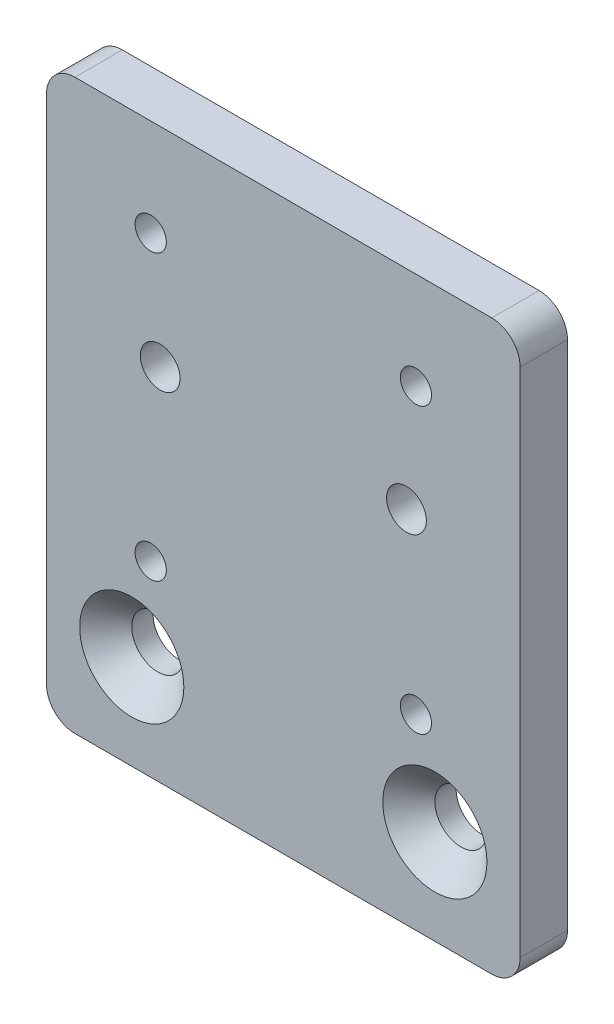
ISO-10303-21;
HEADER;
FILE_DESCRIPTION(('STEP AP214'),'2;1');
FILE_NAME('part.step','',(''),(''),'','','');
FILE_SCHEMA(('AUTOMOTIVE_DESIGN { 1 0 10303 214 1 1 1 1 }'));
ENDSEC;
DATA;
#1=APPLICATION_CONTEXT('core data for automotive mechanical design processes');
#2=APPLICATION_PROTOCOL_DEFINITION('international standard','automotive_design',2000,#1);
#3=PRODUCT_CONTEXT('',#1,'mechanical');
#4=PRODUCT('Part','Part','',(#3));
#5=PRODUCT_RELATED_PRODUCT_CATEGORY('part','',(#4));
#6=PRODUCT_DEFINITION_FORMATION('','',#4);
#7=PRODUCT_DEFINITION_CONTEXT('part definition',#1,'design');
#8=PRODUCT_DEFINITION('design','',#6,#7);
#9=PRODUCT_DEFINITION_SHAPE('','',#8);
#10=(LENGTH_UNIT() NAMED_UNIT(*) SI_UNIT(.MILLI.,.METRE.));
#11=(NAMED_UNIT(*) PLANE_ANGLE_UNIT() SI_UNIT($,.RADIAN.));
#12=(NAMED_UNIT(*) SI_UNIT($,.STERADIAN.) SOLID_ANGLE_UNIT());
#13=UNCERTAINTY_MEASURE_WITH_UNIT(LENGTH_MEASURE(1.E-05),#10,'distance_accuracy_value','');
#14=(GEOMETRIC_REPRESENTATION_CONTEXT(3) GLOBAL_UNCERTAINTY_ASSIGNED_CONTEXT((#13)) GLOBAL_UNIT_ASSIGNED_CONTEXT((#10,
#11,#12)) REPRESENTATION_CONTEXT('',''));
#15=CARTESIAN_POINT('',(0.,0.,0.));
#16=DIRECTION('',(0.,0.,1.));
#17=DIRECTION('',(1.,0.,0.));
#18=AXIS2_PLACEMENT_3D('',#15,#16,#17);
#19=CARTESIAN_POINT('',(25.,0.,-5.));
#20=DIRECTION('',(1.,0.,0.));
#21=DIRECTION('',(0.,0.,-1.));
#22=AXIS2_PLACEMENT_3D('',#19,#20,#21);
#23=PLANE('',#22);
#24=DIRECTION('',(0.,1.,0.));
#25=VECTOR('',#24,1.);
#26=CARTESIAN_POINT('',(25.,0.,-5.));
#27=LINE('',#26,#25);
#28=CARTESIAN_POINT('',(25.,3.,-5.));
#29=VERTEX_POINT('',#28);
#30=CARTESIAN_POINT('',(25.,57.,-5.));
#31=VERTEX_POINT('',#30);
#32=EDGE_CURVE('E192',#29,#31,#27,.T.);
#33=ORIENTED_EDGE('',*,*,#32,.T.);
#34=DIRECTION('',(0.,0.,1.));
#35=VECTOR('',#34,1.);
#36=CARTESIAN_POINT('',(25.,57.,-5.));
#37=LINE('',#36,#35);
#38=CARTESIAN_POINT('',(25.,57.,0.));
#39=VERTEX_POINT('',#38);
#40=EDGE_CURVE('E118',#31,#39,#37,.T.);
#41=ORIENTED_EDGE('',*,*,#40,.T.);
#42=DIRECTION('',(0.,1.,0.));
#43=VECTOR('',#42,1.);
#44=CARTESIAN_POINT('',(25.,0.,0.));
#45=LINE('',#44,#43);
#46=CARTESIAN_POINT('',(25.,3.,0.));
#47=VERTEX_POINT('',#46);
#48=EDGE_CURVE('E109',#47,#39,#45,.T.);
#49=ORIENTED_EDGE('',*,*,#48,.F.);
#50=DIRECTION('',(0.,0.,1.));
#51=VECTOR('',#50,1.);
#52=CARTESIAN_POINT('',(25.,3.,-5.));
#53=LINE('',#52,#51);
#54=EDGE_CURVE('E123',#47,#29,#53,.F.);
#55=ORIENTED_EDGE('',*,*,#54,.T.);
#56=EDGE_LOOP('',(#33,#41,#49,#55));
#57=FACE_BOUND('',#56,.T.);
#58=ADVANCED_FACE('F39',(#57),#23,.T.);
#59=CARTESIAN_POINT('',(25.,0.,-5.));
#60=DIRECTION('',(0.,-1.,0.));
#61=DIRECTION('',(0.,0.,-1.));
#62=AXIS2_PLACEMENT_3D('',#59,#60,#61);
#63=PLANE('',#62);
#64=DIRECTION('',(1.,0.,0.));
#65=VECTOR('',#64,1.);
#66=CARTESIAN_POINT('',(25.,0.,0.));
#67=LINE('',#66,#65);
#68=CARTESIAN_POINT('',(-22.,0.,0.));
#69=VERTEX_POINT('',#68);
#70=CARTESIAN_POINT('',(22.,0.,0.));
#71=VERTEX_POINT('',#70);
#72=EDGE_CURVE('E111',#69,#71,#67,.T.);
#73=ORIENTED_EDGE('',*,*,#72,.F.);
#74=DIRECTION('',(0.,0.,1.));
#75=VECTOR('',#74,1.);
#76=CARTESIAN_POINT('',(-22.,0.,-5.));
#77=LINE('',#76,#75);
#78=CARTESIAN_POINT('',(-22.,0.,-5.));
#79=VERTEX_POINT('',#78);
#80=EDGE_CURVE('E11',#69,#79,#77,.F.);
#81=ORIENTED_EDGE('',*,*,#80,.T.);
#82=DIRECTION('',(1.,0.,0.));
#83=VECTOR('',#82,1.);
#84=CARTESIAN_POINT('',(25.,0.,-5.));
#85=LINE('',#84,#83);
#86=CARTESIAN_POINT('',(22.,0.,-5.));
#87=VERTEX_POINT('',#86);
#88=EDGE_CURVE('E133',#79,#87,#85,.T.);
#89=ORIENTED_EDGE('',*,*,#88,.T.);
#90=DIRECTION('',(0.,0.,1.));
#91=VECTOR('',#90,1.);
#92=CARTESIAN_POINT('',(22.,0.,-5.));
#93=LINE('',#92,#91);
#94=EDGE_CURVE('E48',#87,#71,#93,.T.);
#95=ORIENTED_EDGE('',*,*,#94,.T.);
#96=EDGE_LOOP('',(#73,#81,#89,#95));
#97=FACE_BOUND('',#96,.T.);
#98=ADVANCED_FACE('F177',(#97),#63,.T.);
#99=CARTESIAN_POINT('',(-25.,0.,-5.));
#100=DIRECTION('',(-1.,0.,0.));
#101=DIRECTION('',(0.,0.,1.));
#102=AXIS2_PLACEMENT_3D('',#99,#100,#101);
#103=PLANE('',#102);
#104=DIRECTION('',(0.,-1.,0.));
#105=VECTOR('',#104,1.);
#106=CARTESIAN_POINT('',(-25.,0.,0.));
#107=LINE('',#106,#105);
#108=CARTESIAN_POINT('',(-25.,57.,0.));
#109=VERTEX_POINT('',#108);
#110=CARTESIAN_POINT('',(-25.,3.,0.));
#111=VERTEX_POINT('',#110);
#112=EDGE_CURVE('E186',#109,#111,#107,.T.);
#113=ORIENTED_EDGE('',*,*,#112,.F.);
#114=DIRECTION('',(0.,0.,1.));
#115=VECTOR('',#114,1.);
#116=CARTESIAN_POINT('',(-25.,57.,-5.));
#117=LINE('',#116,#115);
#118=CARTESIAN_POINT('',(-25.,57.,-5.));
#119=VERTEX_POINT('',#118);
#120=EDGE_CURVE('E62',#109,#119,#117,.F.);
#121=ORIENTED_EDGE('',*,*,#120,.T.);
#122=DIRECTION('',(0.,-1.,0.));
#123=VECTOR('',#122,1.);
#124=CARTESIAN_POINT('',(-25.,0.,-5.));
#125=LINE('',#124,#123);
#126=CARTESIAN_POINT('',(-25.,3.,-5.));
#127=VERTEX_POINT('',#126);
#128=EDGE_CURVE('E139',#119,#127,#125,.T.);
#129=ORIENTED_EDGE('',*,*,#128,.T.);
#130=DIRECTION('',(0.,0.,1.));
#131=VECTOR('',#130,1.);
#132=CARTESIAN_POINT('',(-25.,3.,-5.));
#133=LINE('',#132,#131);
#134=EDGE_CURVE('E170',#127,#111,#133,.T.);
#135=ORIENTED_EDGE('',*,*,#134,.T.);
#136=EDGE_LOOP('',(#113,#121,#129,#135));
#137=FACE_BOUND('',#136,.T.);
#138=ADVANCED_FACE('F185',(#137),#103,.T.);
#139=CARTESIAN_POINT('',(25.,60.,-5.));
#140=DIRECTION('',(0.,1.,0.));
#141=DIRECTION('',(-1.,0.,0.));
#142=AXIS2_PLACEMENT_3D('',#139,#140,#141);
#143=PLANE('',#142);
#144=DIRECTION('',(-1.,0.,0.));
#145=VECTOR('',#144,1.);
#146=CARTESIAN_POINT('',(25.,60.,0.));
#147=LINE('',#146,#145);
#148=CARTESIAN_POINT('',(22.,60.,0.));
#149=VERTEX_POINT('',#148);
#150=CARTESIAN_POINT('',(-22.,60.,0.));
#151=VERTEX_POINT('',#150);
#152=EDGE_CURVE('E127',#149,#151,#147,.T.);
#153=ORIENTED_EDGE('',*,*,#152,.F.);
#154=DIRECTION('',(0.,0.,1.));
#155=VECTOR('',#154,1.);
#156=CARTESIAN_POINT('',(22.,60.,-5.));
#157=LINE('',#156,#155);
#158=CARTESIAN_POINT('',(22.,60.,-5.));
#159=VERTEX_POINT('',#158);
#160=EDGE_CURVE('E157',#149,#159,#157,.F.);
#161=ORIENTED_EDGE('',*,*,#160,.T.);
#162=DIRECTION('',(-1.,0.,0.));
#163=VECTOR('',#162,1.);
#164=CARTESIAN_POINT('',(25.,60.,-5.));
#165=LINE('',#164,#163);
#166=CARTESIAN_POINT('',(-22.,60.,-5.));
#167=VERTEX_POINT('',#166);
#168=EDGE_CURVE('E213',#159,#167,#165,.T.);
#169=ORIENTED_EDGE('',*,*,#168,.T.);
#170=DIRECTION('',(0.,0.,1.));
#171=VECTOR('',#170,1.);
#172=CARTESIAN_POINT('',(-22.,60.,-5.));
#173=LINE('',#172,#171);
#174=EDGE_CURVE('E153',#167,#151,#173,.T.);
#175=ORIENTED_EDGE('',*,*,#174,.T.);
#176=EDGE_LOOP('',(#153,#161,#169,#175));
#177=FACE_BOUND('',#176,.T.);
#178=ADVANCED_FACE('F221',(#177),#143,.T.);
#179=CARTESIAN_POINT('',(0.,0.,-5.));
#180=DIRECTION('',(0.,0.,1.));
#181=DIRECTION('',(1.,0.,0.));
#182=AXIS2_PLACEMENT_3D('',#179,#180,#181);
#183=PLANE('',#182);
#184=CARTESIAN_POINT('',(-13.,38.,-5.));
#185=DIRECTION('',(0.,0.,1.));
#186=DIRECTION('',(1.,0.,0.));
#187=AXIS2_PLACEMENT_3D('',#184,#185,#186);
#188=CIRCLE('',#187,2.1);
#189=CARTESIAN_POINT('',(-10.9,38.,-5.));
#190=VERTEX_POINT('',#189);
#191=EDGE_CURVE('E296',#190,#190,#188,.T.);
#192=ORIENTED_EDGE('',*,*,#191,.T.);
#193=EDGE_LOOP('',(#192));
#194=FACE_BOUND('',#193,.T.);
#195=CARTESIAN_POINT('',(13.,38.,-5.));
#196=DIRECTION('',(0.,0.,1.));
#197=DIRECTION('',(1.,0.,0.));
#198=AXIS2_PLACEMENT_3D('',#195,#196,#197);
#199=CIRCLE('',#198,2.1);
#200=CARTESIAN_POINT('',(15.1,38.,-5.));
#201=VERTEX_POINT('',#200);
#202=EDGE_CURVE('E309',#201,#201,#199,.T.);
#203=ORIENTED_EDGE('',*,*,#202,.T.);
#204=EDGE_LOOP('',(#203));
#205=FACE_BOUND('',#204,.T.);
#206=CARTESIAN_POINT('',(-14.,19.75,-5.));
#207=DIRECTION('',(0.,0.,1.));
#208=DIRECTION('',(1.,0.,0.));
#209=AXIS2_PLACEMENT_3D('',#206,#207,#208);
#210=CIRCLE('',#209,1.65);
#211=CARTESIAN_POINT('',(-12.35,19.75,-5.));
#212=VERTEX_POINT('',#211);
#213=EDGE_CURVE('E317',#212,#212,#210,.T.);
#214=ORIENTED_EDGE('',*,*,#213,.T.);
#215=EDGE_LOOP('',(#214));
#216=FACE_BOUND('',#215,.T.);
#217=CARTESIAN_POINT('',(14.,19.75,-5.));
#218=DIRECTION('',(0.,0.,1.));
#219=DIRECTION('',(1.,0.,0.));
#220=AXIS2_PLACEMENT_3D('',#217,#218,#219);
#221=CIRCLE('',#220,1.65);
#222=CARTESIAN_POINT('',(15.65,19.75,-5.));
#223=VERTEX_POINT('',#222);
#224=EDGE_CURVE('E325',#223,#223,#221,.T.);
#225=ORIENTED_EDGE('',*,*,#224,.T.);
#226=EDGE_LOOP('',(#225));
#227=FACE_BOUND('',#226,.T.);
#228=CARTESIAN_POINT('',(-14.,49.75,-5.));
#229=DIRECTION('',(0.,0.,1.));
#230=DIRECTION('',(1.,0.,0.));
#231=AXIS2_PLACEMENT_3D('',#228,#229,#230);
#232=CIRCLE('',#231,1.65);
#233=CARTESIAN_POINT('',(-12.35,49.75,-5.));
#234=VERTEX_POINT('',#233);
#235=EDGE_CURVE('E333',#234,#234,#232,.T.);
#236=ORIENTED_EDGE('',*,*,#235,.T.);
#237=EDGE_LOOP('',(#236));
#238=FACE_BOUND('',#237,.T.);
#239=CARTESIAN_POINT('',(14.,49.75,-5.));
#240=DIRECTION('',(0.,0.,1.));
#241=DIRECTION('',(1.,0.,0.));
#242=AXIS2_PLACEMENT_3D('',#239,#240,#241);
#243=CIRCLE('',#242,1.65);
#244=CARTESIAN_POINT('',(15.65,49.75,-5.));
#245=VERTEX_POINT('',#244);
#246=EDGE_CURVE('E341',#245,#245,#243,.T.);
#247=ORIENTED_EDGE('',*,*,#246,.T.);
#248=EDGE_LOOP('',(#247));
#249=FACE_BOUND('',#248,.T.);
#250=CARTESIAN_POINT('',(-16.,9.99999999999999,-5.));
#251=DIRECTION('',(0.,0.,1.));
#252=DIRECTION('',(1.,0.,0.));
#253=AXIS2_PLACEMENT_3D('',#250,#251,#252);
#254=CIRCLE('',#253,2.75);
#255=CARTESIAN_POINT('',(-13.25,9.99999999999999,-5.));
#256=VERTEX_POINT('',#255);
#257=EDGE_CURVE('E142',#256,#256,#254,.T.);
#258=ORIENTED_EDGE('',*,*,#257,.T.);
#259=EDGE_LOOP('',(#258));
#260=FACE_BOUND('',#259,.T.);
#261=CARTESIAN_POINT('',(16.,9.99999999999999,-5.));
#262=DIRECTION('',(0.,0.,1.));
#263=DIRECTION('',(1.,0.,0.));
#264=AXIS2_PLACEMENT_3D('',#261,#262,#263);
#265=CIRCLE('',#264,2.75);
#266=CARTESIAN_POINT('',(18.75,9.99999999999999,-5.));
#267=VERTEX_POINT('',#266);
#268=EDGE_CURVE('E128',#267,#267,#265,.T.);
#269=ORIENTED_EDGE('',*,*,#268,.T.);
#270=EDGE_LOOP('',(#269));
#271=FACE_BOUND('',#270,.T.);
#272=ORIENTED_EDGE('',*,*,#168,.F.);
#273=CARTESIAN_POINT('',(22.,57.,-5.));
#274=DIRECTION('',(0.,0.,1.));
#275=DIRECTION('',(1.,0.,0.));
#276=AXIS2_PLACEMENT_3D('',#273,#274,#275);
#277=CIRCLE('',#276,3.);
#278=EDGE_CURVE('E167',#159,#31,#277,.F.);
#279=ORIENTED_EDGE('',*,*,#278,.T.);
#280=ORIENTED_EDGE('',*,*,#32,.F.);
#281=CARTESIAN_POINT('',(22.,3.,-5.));
#282=DIRECTION('',(0.,0.,1.));
#283=DIRECTION('',(1.,0.,0.));
#284=AXIS2_PLACEMENT_3D('',#281,#282,#283);
#285=CIRCLE('',#284,3.);
#286=EDGE_CURVE('E131',#29,#87,#285,.F.);
#287=ORIENTED_EDGE('',*,*,#286,.T.);
#288=ORIENTED_EDGE('',*,*,#88,.F.);
#289=CARTESIAN_POINT('',(-22.,3.,-5.));
#290=DIRECTION('',(0.,0.,1.));
#291=DIRECTION('',(1.,0.,0.));
#292=AXIS2_PLACEMENT_3D('',#289,#290,#291);
#293=CIRCLE('',#292,3.);
#294=EDGE_CURVE('E55',#79,#127,#293,.F.);
#295=ORIENTED_EDGE('',*,*,#294,.T.);
#296=ORIENTED_EDGE('',*,*,#128,.F.);
#297=CARTESIAN_POINT('',(-22.,57.,-5.));
#298=DIRECTION('',(0.,0.,1.));
#299=DIRECTION('',(1.,0.,0.));
#300=AXIS2_PLACEMENT_3D('',#297,#298,#299);
#301=CIRCLE('',#300,3.);
#302=EDGE_CURVE('E164',#119,#167,#301,.F.);
#303=ORIENTED_EDGE('',*,*,#302,.T.);
#304=EDGE_LOOP('',(#272,#279,#280,#287,#288,#295,#296,#303));
#305=FACE_BOUND('',#304,.T.);
#306=ADVANCED_FACE('F180',(#194,#205,#216,#227,#238,#249,#260,#271,#305),#183,.F.);
#307=CARTESIAN_POINT('',(0.,0.,0.));
#308=DIRECTION('',(0.,0.,1.));
#309=DIRECTION('',(1.,0.,0.));
#310=AXIS2_PLACEMENT_3D('',#307,#308,#309);
#311=PLANE('',#310);
#312=CARTESIAN_POINT('',(-13.,38.,0.));
#313=DIRECTION('',(0.,0.,1.));
#314=DIRECTION('',(1.,0.,0.));
#315=AXIS2_PLACEMENT_3D('',#312,#313,#314);
#316=CIRCLE('',#315,2.1);
#317=CARTESIAN_POINT('',(-10.9,38.,0.));
#318=VERTEX_POINT('',#317);
#319=EDGE_CURVE('E299',#318,#318,#316,.T.);
#320=ORIENTED_EDGE('',*,*,#319,.F.);
#321=EDGE_LOOP('',(#320));
#322=FACE_BOUND('',#321,.T.);
#323=CARTESIAN_POINT('',(13.,38.,0.));
#324=DIRECTION('',(0.,0.,1.));
#325=DIRECTION('',(1.,0.,0.));
#326=AXIS2_PLACEMENT_3D('',#323,#324,#325);
#327=CIRCLE('',#326,2.1);
#328=CARTESIAN_POINT('',(15.1,38.,0.));
#329=VERTEX_POINT('',#328);
#330=EDGE_CURVE('E303',#329,#329,#327,.T.);
#331=ORIENTED_EDGE('',*,*,#330,.F.);
#332=EDGE_LOOP('',(#331));
#333=FACE_BOUND('',#332,.T.);
#334=CARTESIAN_POINT('',(-14.,19.75,0.));
#335=DIRECTION('',(0.,0.,1.));
#336=DIRECTION('',(1.,0.,0.));
#337=AXIS2_PLACEMENT_3D('',#334,#335,#336);
#338=CIRCLE('',#337,1.64999999999999);
#339=CARTESIAN_POINT('',(-12.35,19.75,0.));
#340=VERTEX_POINT('',#339);
#341=EDGE_CURVE('E313',#340,#340,#338,.T.);
#342=ORIENTED_EDGE('',*,*,#341,.F.);
#343=EDGE_LOOP('',(#342));
#344=FACE_BOUND('',#343,.T.);
#345=CARTESIAN_POINT('',(14.,19.75,0.));
#346=DIRECTION('',(0.,0.,1.));
#347=DIRECTION('',(1.,0.,0.));
#348=AXIS2_PLACEMENT_3D('',#345,#346,#347);
#349=CIRCLE('',#348,1.64999999999999);
#350=CARTESIAN_POINT('',(15.65,19.75,0.));
#351=VERTEX_POINT('',#350);
#352=EDGE_CURVE('E321',#351,#351,#349,.T.);
#353=ORIENTED_EDGE('',*,*,#352,.F.);
#354=EDGE_LOOP('',(#353));
#355=FACE_BOUND('',#354,.T.);
#356=CARTESIAN_POINT('',(-14.,49.75,0.));
#357=DIRECTION('',(0.,0.,1.));
#358=DIRECTION('',(1.,0.,0.));
#359=AXIS2_PLACEMENT_3D('',#356,#357,#358);
#360=CIRCLE('',#359,1.64999999999999);
#361=CARTESIAN_POINT('',(-12.35,49.75,0.));
#362=VERTEX_POINT('',#361);
#363=EDGE_CURVE('E329',#362,#362,#360,.T.);
#364=ORIENTED_EDGE('',*,*,#363,.F.);
#365=EDGE_LOOP('',(#364));
#366=FACE_BOUND('',#365,.T.);
#367=CARTESIAN_POINT('',(14.,49.75,0.));
#368=DIRECTION('',(0.,0.,1.));
#369=DIRECTION('',(1.,0.,0.));
#370=AXIS2_PLACEMENT_3D('',#367,#368,#369);
#371=CIRCLE('',#370,1.64999999999999);
#372=CARTESIAN_POINT('',(15.65,49.75,0.));
#373=VERTEX_POINT('',#372);
#374=EDGE_CURVE('E337',#373,#373,#371,.T.);
#375=ORIENTED_EDGE('',*,*,#374,.F.);
#376=EDGE_LOOP('',(#375));
#377=FACE_BOUND('',#376,.T.);
#378=CARTESIAN_POINT('',(-16.,9.99999999999999,0.));
#379=DIRECTION('',(0.,0.,1.));
#380=DIRECTION('',(1.,0.,0.));
#381=AXIS2_PLACEMENT_3D('',#378,#379,#380);
#382=CIRCLE('',#381,5.5);
#383=CARTESIAN_POINT('',(-10.5,9.99999999999999,0.));
#384=VERTEX_POINT('',#383);
#385=EDGE_CURVE('E345',#384,#384,#382,.T.);
#386=ORIENTED_EDGE('',*,*,#385,.F.);
#387=EDGE_LOOP('',(#386));
#388=FACE_BOUND('',#387,.T.);
#389=CARTESIAN_POINT('',(16.,9.99999999999999,0.));
#390=DIRECTION('',(0.,0.,1.));
#391=DIRECTION('',(1.,0.,0.));
#392=AXIS2_PLACEMENT_3D('',#389,#390,#391);
#393=CIRCLE('',#392,5.5);
#394=CARTESIAN_POINT('',(21.5,9.99999999999999,0.));
#395=VERTEX_POINT('',#394);
#396=EDGE_CURVE('E202',#395,#395,#393,.T.);
#397=ORIENTED_EDGE('',*,*,#396,.F.);
#398=EDGE_LOOP('',(#397));
#399=FACE_BOUND('',#398,.T.);
#400=ORIENTED_EDGE('',*,*,#48,.T.);
#401=CARTESIAN_POINT('',(22.,57.,0.));
#402=DIRECTION('',(0.,0.,1.));
#403=DIRECTION('',(1.,0.,0.));
#404=AXIS2_PLACEMENT_3D('',#401,#402,#403);
#405=CIRCLE('',#404,3.);
#406=EDGE_CURVE('E150',#39,#149,#405,.T.);
#407=ORIENTED_EDGE('',*,*,#406,.T.);
#408=ORIENTED_EDGE('',*,*,#152,.T.);
#409=CARTESIAN_POINT('',(-22.,57.,0.));
#410=DIRECTION('',(0.,0.,1.));
#411=DIRECTION('',(1.,0.,0.));
#412=AXIS2_PLACEMENT_3D('',#409,#410,#411);
#413=CIRCLE('',#412,3.);
#414=EDGE_CURVE('E147',#151,#109,#413,.T.);
#415=ORIENTED_EDGE('',*,*,#414,.T.);
#416=ORIENTED_EDGE('',*,*,#112,.T.);
#417=CARTESIAN_POINT('',(-22.,3.,0.));
#418=DIRECTION('',(0.,0.,1.));
#419=DIRECTION('',(1.,0.,0.));
#420=AXIS2_PLACEMENT_3D('',#417,#418,#419);
#421=CIRCLE('',#420,3.);
#422=EDGE_CURVE('E117',#111,#69,#421,.T.);
#423=ORIENTED_EDGE('',*,*,#422,.T.);
#424=ORIENTED_EDGE('',*,*,#72,.T.);
#425=CARTESIAN_POINT('',(22.,3.,0.));
#426=DIRECTION('',(0.,0.,1.));
#427=DIRECTION('',(1.,0.,0.));
#428=AXIS2_PLACEMENT_3D('',#425,#426,#427);
#429=CIRCLE('',#428,3.);
#430=EDGE_CURVE('E106',#71,#47,#429,.T.);
#431=ORIENTED_EDGE('',*,*,#430,.T.);
#432=EDGE_LOOP('',(#400,#407,#408,#415,#416,#423,#424,#431));
#433=FACE_BOUND('',#432,.T.);
#434=ADVANCED_FACE('F108',(#322,#333,#344,#355,#366,#377,#388,#399,#433),#311,.T.);
#435=CARTESIAN_POINT('',(16.,9.99999999999999,0.));
#436=DIRECTION('',(0.,0.,1.));
#437=DIRECTION('',(1.,0.,0.));
#438=AXIS2_PLACEMENT_3D('',#435,#436,#437);
#439=CYLINDRICAL_SURFACE('',#438,2.75);
#440=CARTESIAN_POINT('',(16.,9.99999999999999,-2.75));
#441=DIRECTION('',(0.,0.,1.));
#442=DIRECTION('',(1.,0.,0.));
#443=AXIS2_PLACEMENT_3D('',#440,#441,#442);
#444=CIRCLE('',#443,2.75);
#445=CARTESIAN_POINT('',(18.75,9.99999999999999,-2.75));
#446=VERTEX_POINT('',#445);
#447=EDGE_CURVE('E197',#446,#446,#444,.T.);
#448=ORIENTED_EDGE('',*,*,#447,.T.);
#449=EDGE_LOOP('',(#448));
#450=FACE_BOUND('',#449,.T.);
#451=ORIENTED_EDGE('',*,*,#268,.F.);
#452=EDGE_LOOP('',(#451));
#453=FACE_BOUND('',#452,.T.);
#454=ADVANCED_FACE('F250',(#450,#453),#439,.F.);
#455=CARTESIAN_POINT('',(16.,9.99999999999999,0.));
#456=DIRECTION('',(0.,0.,1.));
#457=DIRECTION('',(1.,0.,0.));
#458=AXIS2_PLACEMENT_3D('',#455,#456,#457);
#459=CONICAL_SURFACE('',#458,5.5,0.785398163397448);
#460=ORIENTED_EDGE('',*,*,#447,.F.);
#461=EDGE_LOOP('',(#460));
#462=FACE_BOUND('',#461,.T.);
#463=ORIENTED_EDGE('',*,*,#396,.T.);
#464=EDGE_LOOP('',(#463));
#465=FACE_BOUND('',#464,.T.);
#466=ADVANCED_FACE('F257',(#462,#465),#459,.F.);
#467=CARTESIAN_POINT('',(-16.,9.99999999999999,0.));
#468=DIRECTION('',(0.,0.,1.));
#469=DIRECTION('',(1.,0.,0.));
#470=AXIS2_PLACEMENT_3D('',#467,#468,#469);
#471=CYLINDRICAL_SURFACE('',#470,2.75);
#472=CARTESIAN_POINT('',(-16.,9.99999999999999,-2.75));
#473=DIRECTION('',(0.,0.,1.));
#474=DIRECTION('',(1.,0.,0.));
#475=AXIS2_PLACEMENT_3D('',#472,#473,#474);
#476=CIRCLE('',#475,2.75);
#477=CARTESIAN_POINT('',(-13.25,9.99999999999999,-2.75));
#478=VERTEX_POINT('',#477);
#479=EDGE_CURVE('E348',#478,#478,#476,.T.);
#480=ORIENTED_EDGE('',*,*,#479,.T.);
#481=EDGE_LOOP('',(#480));
#482=FACE_BOUND('',#481,.T.);
#483=ORIENTED_EDGE('',*,*,#257,.F.);
#484=EDGE_LOOP('',(#483));
#485=FACE_BOUND('',#484,.T.);
#486=ADVANCED_FACE('F260',(#482,#485),#471,.F.);
#487=CARTESIAN_POINT('',(-16.,9.99999999999999,0.));
#488=DIRECTION('',(0.,0.,1.));
#489=DIRECTION('',(1.,0.,0.));
#490=AXIS2_PLACEMENT_3D('',#487,#488,#489);
#491=CONICAL_SURFACE('',#490,5.5,0.785398163397448);
#492=ORIENTED_EDGE('',*,*,#479,.F.);
#493=EDGE_LOOP('',(#492));
#494=FACE_BOUND('',#493,.T.);
#495=ORIENTED_EDGE('',*,*,#385,.T.);
#496=EDGE_LOOP('',(#495));
#497=FACE_BOUND('',#496,.T.);
#498=ADVANCED_FACE('F264',(#494,#497),#491,.F.);
#499=CARTESIAN_POINT('',(14.,49.75,0.));
#500=DIRECTION('',(0.,0.,1.));
#501=DIRECTION('',(1.,0.,0.));
#502=AXIS2_PLACEMENT_3D('',#499,#500,#501);
#503=CYLINDRICAL_SURFACE('',#502,1.64999999999999);
#504=ORIENTED_EDGE('',*,*,#246,.F.);
#505=EDGE_LOOP('',(#504));
#506=FACE_BOUND('',#505,.T.);
#507=ORIENTED_EDGE('',*,*,#374,.T.);
#508=EDGE_LOOP('',(#507));
#509=FACE_BOUND('',#508,.T.);
#510=ADVANCED_FACE('F268',(#506,#509),#503,.F.);
#511=CARTESIAN_POINT('',(-14.,49.75,0.));
#512=DIRECTION('',(0.,0.,1.));
#513=DIRECTION('',(1.,0.,0.));
#514=AXIS2_PLACEMENT_3D('',#511,#512,#513);
#515=CYLINDRICAL_SURFACE('',#514,1.64999999999999);
#516=ORIENTED_EDGE('',*,*,#235,.F.);
#517=EDGE_LOOP('',(#516));
#518=FACE_BOUND('',#517,.T.);
#519=ORIENTED_EDGE('',*,*,#363,.T.);
#520=EDGE_LOOP('',(#519));
#521=FACE_BOUND('',#520,.T.);
#522=ADVANCED_FACE('F272',(#518,#521),#515,.F.);
#523=CARTESIAN_POINT('',(14.,19.75,0.));
#524=DIRECTION('',(0.,0.,1.));
#525=DIRECTION('',(1.,0.,0.));
#526=AXIS2_PLACEMENT_3D('',#523,#524,#525);
#527=CYLINDRICAL_SURFACE('',#526,1.64999999999999);
#528=ORIENTED_EDGE('',*,*,#224,.F.);
#529=EDGE_LOOP('',(#528));
#530=FACE_BOUND('',#529,.T.);
#531=ORIENTED_EDGE('',*,*,#352,.T.);
#532=EDGE_LOOP('',(#531));
#533=FACE_BOUND('',#532,.T.);
#534=ADVANCED_FACE('F276',(#530,#533),#527,.F.);
#535=CARTESIAN_POINT('',(-14.,19.75,0.));
#536=DIRECTION('',(0.,0.,1.));
#537=DIRECTION('',(1.,0.,0.));
#538=AXIS2_PLACEMENT_3D('',#535,#536,#537);
#539=CYLINDRICAL_SURFACE('',#538,1.64999999999999);
#540=ORIENTED_EDGE('',*,*,#213,.F.);
#541=EDGE_LOOP('',(#540));
#542=FACE_BOUND('',#541,.T.);
#543=ORIENTED_EDGE('',*,*,#341,.T.);
#544=EDGE_LOOP('',(#543));
#545=FACE_BOUND('',#544,.T.);
#546=ADVANCED_FACE('F280',(#542,#545),#539,.F.);
#547=CARTESIAN_POINT('',(13.,38.,0.));
#548=DIRECTION('',(0.,0.,1.));
#549=DIRECTION('',(1.,0.,0.));
#550=AXIS2_PLACEMENT_3D('',#547,#548,#549);
#551=CYLINDRICAL_SURFACE('',#550,2.1);
#552=ORIENTED_EDGE('',*,*,#202,.F.);
#553=EDGE_LOOP('',(#552));
#554=FACE_BOUND('',#553,.T.);
#555=ORIENTED_EDGE('',*,*,#330,.T.);
#556=EDGE_LOOP('',(#555));
#557=FACE_BOUND('',#556,.T.);
#558=ADVANCED_FACE('F284',(#554,#557),#551,.F.);
#559=CARTESIAN_POINT('',(-13.,38.,0.));
#560=DIRECTION('',(0.,0.,1.));
#561=DIRECTION('',(1.,0.,0.));
#562=AXIS2_PLACEMENT_3D('',#559,#560,#561);
#563=CYLINDRICAL_SURFACE('',#562,2.1);
#564=ORIENTED_EDGE('',*,*,#191,.F.);
#565=EDGE_LOOP('',(#564));
#566=FACE_BOUND('',#565,.T.);
#567=ORIENTED_EDGE('',*,*,#319,.T.);
#568=EDGE_LOOP('',(#567));
#569=FACE_BOUND('',#568,.T.);
#570=ADVANCED_FACE('F234',(#566,#569),#563,.F.);
#571=CARTESIAN_POINT('',(22.,57.,-5.));
#572=DIRECTION('',(0.,0.,1.));
#573=DIRECTION('',(1.,0.,0.));
#574=AXIS2_PLACEMENT_3D('',#571,#572,#573);
#575=CYLINDRICAL_SURFACE('',#574,3.);
#576=ORIENTED_EDGE('',*,*,#278,.F.);
#577=ORIENTED_EDGE('',*,*,#160,.F.);
#578=ORIENTED_EDGE('',*,*,#406,.F.);
#579=ORIENTED_EDGE('',*,*,#40,.F.);
#580=EDGE_LOOP('',(#576,#577,#578,#579));
#581=FACE_BOUND('',#580,.T.);
#582=ADVANCED_FACE('F228',(#581),#575,.T.);
#583=CARTESIAN_POINT('',(-22.,57.,-5.));
#584=DIRECTION('',(0.,0.,1.));
#585=DIRECTION('',(1.,0.,0.));
#586=AXIS2_PLACEMENT_3D('',#583,#584,#585);
#587=CYLINDRICAL_SURFACE('',#586,3.);
#588=ORIENTED_EDGE('',*,*,#302,.F.);
#589=ORIENTED_EDGE('',*,*,#120,.F.);
#590=ORIENTED_EDGE('',*,*,#414,.F.);
#591=ORIENTED_EDGE('',*,*,#174,.F.);
#592=EDGE_LOOP('',(#588,#589,#590,#591));
#593=FACE_BOUND('',#592,.T.);
#594=ADVANCED_FACE('F226',(#593),#587,.T.);
#595=CARTESIAN_POINT('',(-22.,3.,-5.));
#596=DIRECTION('',(0.,0.,1.));
#597=DIRECTION('',(1.,0.,0.));
#598=AXIS2_PLACEMENT_3D('',#595,#596,#597);
#599=CYLINDRICAL_SURFACE('',#598,3.);
#600=ORIENTED_EDGE('',*,*,#294,.F.);
#601=ORIENTED_EDGE('',*,*,#80,.F.);
#602=ORIENTED_EDGE('',*,*,#422,.F.);
#603=ORIENTED_EDGE('',*,*,#134,.F.);
#604=EDGE_LOOP('',(#600,#601,#602,#603));
#605=FACE_BOUND('',#604,.T.);
#606=ADVANCED_FACE('F183',(#605),#599,.T.);
#607=CARTESIAN_POINT('',(22.,3.,-5.));
#608=DIRECTION('',(0.,0.,1.));
#609=DIRECTION('',(1.,0.,0.));
#610=AXIS2_PLACEMENT_3D('',#607,#608,#609);
#611=CYLINDRICAL_SURFACE('',#610,3.);
#612=ORIENTED_EDGE('',*,*,#286,.F.);
#613=ORIENTED_EDGE('',*,*,#54,.F.);
#614=ORIENTED_EDGE('',*,*,#430,.F.);
#615=ORIENTED_EDGE('',*,*,#94,.F.);
#616=EDGE_LOOP('',(#612,#613,#614,#615));
#617=FACE_BOUND('',#616,.T.);
#618=ADVANCED_FACE('F41',(#617),#611,.T.);
#619=CLOSED_SHELL('',(#58,#98,#138,#178,#306,#434,#454,#466,#486,#498,#510,#522,#534,#546,#558,
#570,#582,#594,#606,#618));
#620=MANIFOLD_SOLID_BREP('B2',#619);
#621=ADVANCED_BREP_SHAPE_REPRESENTATION('',(#18,#620),#14);
#622=SHAPE_DEFINITION_REPRESENTATION(#9,#621);
ENDSEC;
END-ISO-10303-21;
